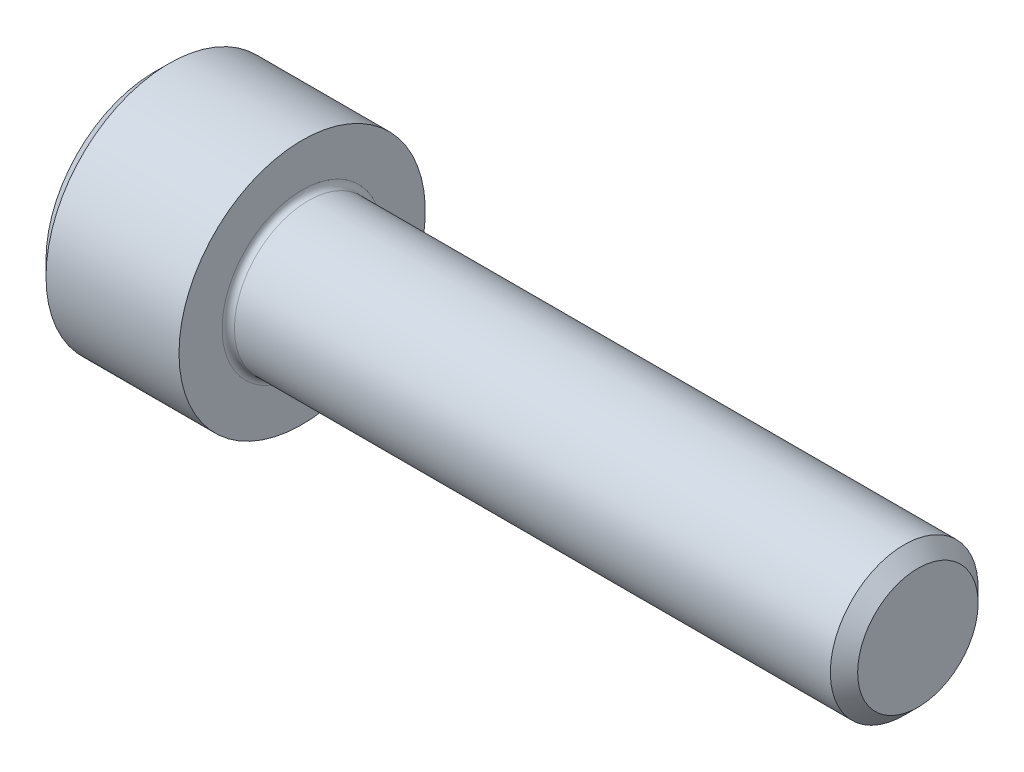
ISO-10303-21;
HEADER;
FILE_DESCRIPTION(('STEP AP214'),'2;1');
FILE_NAME('part.step','',(''),(''),'','','');
FILE_SCHEMA(('AUTOMOTIVE_DESIGN { 1 0 10303 214 1 1 1 1 }'));
ENDSEC;
DATA;
#1=APPLICATION_CONTEXT('core data for automotive mechanical design processes');
#2=APPLICATION_PROTOCOL_DEFINITION('international standard','automotive_design',2000,#1);
#3=PRODUCT_CONTEXT('',#1,'mechanical');
#4=PRODUCT('Part','Part','',(#3));
#5=PRODUCT_RELATED_PRODUCT_CATEGORY('part','',(#4));
#6=PRODUCT_DEFINITION_FORMATION('','',#4);
#7=PRODUCT_DEFINITION_CONTEXT('part definition',#1,'design');
#8=PRODUCT_DEFINITION('design','',#6,#7);
#9=PRODUCT_DEFINITION_SHAPE('','',#8);
#10=(LENGTH_UNIT() NAMED_UNIT(*) SI_UNIT(.MILLI.,.METRE.));
#11=(NAMED_UNIT(*) PLANE_ANGLE_UNIT() SI_UNIT($,.RADIAN.));
#12=(NAMED_UNIT(*) SI_UNIT($,.STERADIAN.) SOLID_ANGLE_UNIT());
#13=UNCERTAINTY_MEASURE_WITH_UNIT(LENGTH_MEASURE(1.E-05),#10,'distance_accuracy_value','');
#14=(GEOMETRIC_REPRESENTATION_CONTEXT(3) GLOBAL_UNCERTAINTY_ASSIGNED_CONTEXT((#13)) GLOBAL_UNIT_ASSIGNED_CONTEXT((#10,
#11,#12)) REPRESENTATION_CONTEXT('',''));
#15=CARTESIAN_POINT('',(0.,0.,0.));
#16=DIRECTION('',(0.,0.,1.));
#17=DIRECTION('',(1.,0.,0.));
#18=AXIS2_PLACEMENT_3D('',#15,#16,#17);
#19=CARTESIAN_POINT('',(0.,0.,0.));
#20=DIRECTION('',(-1.,0.,0.));
#21=DIRECTION('',(0.,0.,1.));
#22=AXIS2_PLACEMENT_3D('',#19,#20,#21);
#23=PLANE('',#22);
#24=DIRECTION('',(0.,-0.5,0.866025403784438));
#25=VECTOR('',#24,1.);
#26=CARTESIAN_POINT('',(0.,2.93524876856006,0.));
#27=LINE('',#26,#25);
#28=CARTESIAN_POINT('',(0.,2.93524876856006,0.));
#29=VERTEX_POINT('',#28);
#30=CARTESIAN_POINT('',(0.,1.46762438428003,2.542));
#31=VERTEX_POINT('',#30);
#32=EDGE_CURVE('E309',#29,#31,#27,.T.);
#33=ORIENTED_EDGE('',*,*,#32,.T.);
#34=DIRECTION('',(0.,1.,0.));
#35=VECTOR('',#34,1.);
#36=CARTESIAN_POINT('',(0.,-1.46762438428003,2.542));
#37=LINE('',#36,#35);
#38=CARTESIAN_POINT('',(0.,-1.46762438428003,2.542));
#39=VERTEX_POINT('',#38);
#40=EDGE_CURVE('E163',#39,#31,#37,.T.);
#41=ORIENTED_EDGE('',*,*,#40,.F.);
#42=DIRECTION('',(0.,-0.500000000000001,-0.866025403784438));
#43=VECTOR('',#42,1.);
#44=CARTESIAN_POINT('',(0.,-1.46762438428003,2.542));
#45=LINE('',#44,#43);
#46=CARTESIAN_POINT('',(0.,-2.93524876856006,0.));
#47=VERTEX_POINT('',#46);
#48=EDGE_CURVE('E314',#39,#47,#45,.T.);
#49=ORIENTED_EDGE('',*,*,#48,.T.);
#50=DIRECTION('',(0.,0.5,-0.866025403784439));
#51=VECTOR('',#50,1.);
#52=CARTESIAN_POINT('',(0.,-2.93524876856006,0.));
#53=LINE('',#52,#51);
#54=CARTESIAN_POINT('',(0.,-1.46762438428003,-2.542));
#55=VERTEX_POINT('',#54);
#56=EDGE_CURVE('E318',#47,#55,#53,.T.);
#57=ORIENTED_EDGE('',*,*,#56,.T.);
#58=DIRECTION('',(0.,-1.,0.));
#59=VECTOR('',#58,1.);
#60=CARTESIAN_POINT('',(0.,1.46762438428002,-2.542));
#61=LINE('',#60,#59);
#62=CARTESIAN_POINT('',(0.,1.46762438428002,-2.542));
#63=VERTEX_POINT('',#62);
#64=EDGE_CURVE('E322',#63,#55,#61,.T.);
#65=ORIENTED_EDGE('',*,*,#64,.F.);
#66=DIRECTION('',(0.,-0.500000000000001,-0.866025403784438));
#67=VECTOR('',#66,1.);
#68=CARTESIAN_POINT('',(0.,2.93524876856006,0.));
#69=LINE('',#68,#67);
#70=EDGE_CURVE('E158',#29,#63,#69,.T.);
#71=ORIENTED_EDGE('',*,*,#70,.F.);
#72=EDGE_LOOP('',(#33,#41,#49,#57,#65,#71));
#73=FACE_BOUND('',#72,.T.);
#74=CARTESIAN_POINT('',(0.,0.,0.));
#75=DIRECTION('',(-1.,0.,0.));
#76=DIRECTION('',(0.,0.,1.));
#77=AXIS2_PLACEMENT_3D('',#74,#75,#76);
#78=CIRCLE('',#77,4.4);
#79=CARTESIAN_POINT('',(0.,0.,4.4));
#80=VERTEX_POINT('',#79);
#81=EDGE_CURVE('E196',#80,#80,#78,.T.);
#82=ORIENTED_EDGE('',*,*,#81,.T.);
#83=EDGE_LOOP('',(#82));
#84=FACE_BOUND('',#83,.T.);
#85=ADVANCED_FACE('F45',(#73,#84),#23,.T.);
#86=CARTESIAN_POINT('',(0.,0.,0.));
#87=DIRECTION('',(1.,0.,0.));
#88=DIRECTION('',(0.,0.,-1.));
#89=AXIS2_PLACEMENT_3D('',#86,#87,#88);
#90=CONICAL_SURFACE('',#89,4.4,0.785398163397448);
#91=CARTESIAN_POINT('',(0.600000000000003,0.,0.));
#92=DIRECTION('',(-1.,0.,0.));
#93=DIRECTION('',(0.,0.,1.));
#94=AXIS2_PLACEMENT_3D('',#91,#92,#93);
#95=CIRCLE('',#94,5.);
#96=CARTESIAN_POINT('',(0.600000000000003,0.,5.));
#97=VERTEX_POINT('',#96);
#98=EDGE_CURVE('E192',#97,#97,#95,.T.);
#99=ORIENTED_EDGE('',*,*,#98,.T.);
#100=EDGE_LOOP('',(#99));
#101=FACE_BOUND('',#100,.T.);
#102=ORIENTED_EDGE('',*,*,#81,.F.);
#103=EDGE_LOOP('',(#102));
#104=FACE_BOUND('',#103,.T.);
#105=ADVANCED_FACE('F219',(#101,#104),#90,.T.);
#106=CARTESIAN_POINT('',(-31.75,0.,0.));
#107=DIRECTION('',(-1.,0.,0.));
#108=DIRECTION('',(0.,0.,1.));
#109=AXIS2_PLACEMENT_3D('',#106,#107,#108);
#110=CYLINDRICAL_SURFACE('',#109,5.);
#111=CARTESIAN_POINT('',(6.,0.,0.));
#112=DIRECTION('',(-1.,0.,0.));
#113=DIRECTION('',(0.,0.,1.));
#114=AXIS2_PLACEMENT_3D('',#111,#112,#113);
#115=CIRCLE('',#114,5.);
#116=CARTESIAN_POINT('',(6.,0.,5.));
#117=VERTEX_POINT('',#116);
#118=EDGE_CURVE('E188',#117,#117,#115,.T.);
#119=ORIENTED_EDGE('',*,*,#118,.T.);
#120=EDGE_LOOP('',(#119));
#121=FACE_BOUND('',#120,.T.);
#122=ORIENTED_EDGE('',*,*,#98,.F.);
#123=EDGE_LOOP('',(#122));
#124=FACE_BOUND('',#123,.T.);
#125=ADVANCED_FACE('F224',(#121,#124),#110,.T.);
#126=CARTESIAN_POINT('',(6.,5.,0.));
#127=DIRECTION('',(1.,0.,0.));
#128=DIRECTION('',(0.,0.,-1.));
#129=AXIS2_PLACEMENT_3D('',#126,#127,#128);
#130=PLANE('',#129);
#131=CARTESIAN_POINT('',(6.,0.,0.));
#132=DIRECTION('',(1.,0.,0.));
#133=DIRECTION('',(0.,0.,-1.));
#134=AXIS2_PLACEMENT_3D('',#131,#132,#133);
#135=CIRCLE('',#134,3.24999999999996);
#136=CARTESIAN_POINT('',(6.,0.,-3.24999999999996));
#137=VERTEX_POINT('',#136);
#138=EDGE_CURVE('E54',#137,#137,#135,.F.);
#139=ORIENTED_EDGE('',*,*,#138,.T.);
#140=EDGE_LOOP('',(#139));
#141=FACE_BOUND('',#140,.T.);
#142=ORIENTED_EDGE('',*,*,#118,.F.);
#143=EDGE_LOOP('',(#142));
#144=FACE_BOUND('',#143,.T.);
#145=ADVANCED_FACE('F203',(#141,#144),#130,.T.);
#146=CARTESIAN_POINT('',(-31.75,0.,0.));
#147=DIRECTION('',(-1.,0.,0.));
#148=DIRECTION('',(0.,0.,1.));
#149=AXIS2_PLACEMENT_3D('',#146,#147,#148);
#150=CYLINDRICAL_SURFACE('',#149,2.99999999999996);
#151=CARTESIAN_POINT('',(6.25,0.,0.));
#152=DIRECTION('',(1.,0.,0.));
#153=DIRECTION('',(0.,0.,-1.));
#154=AXIS2_PLACEMENT_3D('',#151,#152,#153);
#155=CIRCLE('',#154,2.99999999999996);
#156=CARTESIAN_POINT('',(6.25,0.,-2.99999999999996));
#157=VERTEX_POINT('',#156);
#158=EDGE_CURVE('E11',#157,#157,#155,.T.);
#159=ORIENTED_EDGE('',*,*,#158,.T.);
#160=EDGE_LOOP('',(#159));
#161=FACE_BOUND('',#160,.T.);
#162=CARTESIAN_POINT('',(30.4454999999999,0.,0.));
#163=DIRECTION('',(-1.,0.,0.));
#164=DIRECTION('',(0.,0.,1.));
#165=AXIS2_PLACEMENT_3D('',#162,#163,#164);
#166=CIRCLE('',#165,2.99999999999991);
#167=CARTESIAN_POINT('',(30.4454999999999,0.,2.99999999999991));
#168=VERTEX_POINT('',#167);
#169=EDGE_CURVE('E184',#168,#168,#166,.T.);
#170=ORIENTED_EDGE('',*,*,#169,.T.);
#171=EDGE_LOOP('',(#170));
#172=FACE_BOUND('',#171,.T.);
#173=ADVANCED_FACE('F234',(#161,#172),#150,.T.);
#174=CARTESIAN_POINT('',(31.,0.,0.));
#175=DIRECTION('',(-1.,0.,0.));
#176=DIRECTION('',(0.,0.,1.));
#177=AXIS2_PLACEMENT_3D('',#174,#175,#176);
#178=CONICAL_SURFACE('',#177,2.4455,0.785398163397305);
#179=ORIENTED_EDGE('',*,*,#169,.F.);
#180=EDGE_LOOP('',(#179));
#181=FACE_BOUND('',#180,.T.);
#182=CARTESIAN_POINT('',(31.,0.,0.));
#183=DIRECTION('',(-1.,0.,0.));
#184=DIRECTION('',(0.,0.,1.));
#185=AXIS2_PLACEMENT_3D('',#182,#183,#184);
#186=CIRCLE('',#185,2.4455);
#187=CARTESIAN_POINT('',(31.,0.,2.4455));
#188=VERTEX_POINT('',#187);
#189=EDGE_CURVE('E179',#188,#188,#186,.T.);
#190=ORIENTED_EDGE('',*,*,#189,.T.);
#191=EDGE_LOOP('',(#190));
#192=FACE_BOUND('',#191,.T.);
#193=ADVANCED_FACE('F214',(#181,#192),#178,.T.);
#194=CARTESIAN_POINT('',(31.,2.4455,0.));
#195=DIRECTION('',(1.,0.,0.));
#196=DIRECTION('',(0.,0.,-1.));
#197=AXIS2_PLACEMENT_3D('',#194,#195,#196);
#198=PLANE('',#197);
#199=ORIENTED_EDGE('',*,*,#189,.F.);
#200=EDGE_LOOP('',(#199));
#201=FACE_BOUND('',#200,.T.);
#202=ADVANCED_FACE('F207',(#201),#198,.T.);
#203=CARTESIAN_POINT('',(6.25,0.,0.));
#204=DIRECTION('',(1.,0.,0.));
#205=DIRECTION('',(0.,0.,-1.));
#206=AXIS2_PLACEMENT_3D('',#203,#204,#205);
#207=TOROIDAL_SURFACE('',#206,3.24999999999996,0.25);
#208=ORIENTED_EDGE('',*,*,#158,.F.);
#209=EDGE_LOOP('',(#208));
#210=FACE_BOUND('',#209,.T.);
#211=ORIENTED_EDGE('',*,*,#138,.F.);
#212=EDGE_LOOP('',(#211));
#213=FACE_BOUND('',#212,.T.);
#214=ADVANCED_FACE('F47',(#210,#213),#207,.F.);
#215=CARTESIAN_POINT('',(3.,2.93524876856006,0.));
#216=DIRECTION('',(0.,-0.866025403784439,-0.5));
#217=DIRECTION('',(0.,0.5,-0.866025403784439));
#218=AXIS2_PLACEMENT_3D('',#215,#216,#217);
#219=PLANE('',#218);
#220=ORIENTED_EDGE('',*,*,#32,.F.);
#221=DIRECTION('',(-1.,0.,0.));
#222=VECTOR('',#221,1.);
#223=CARTESIAN_POINT('',(3.,2.93524876856006,0.));
#224=LINE('',#223,#222);
#225=CARTESIAN_POINT('',(3.,2.93524876856006,0.));
#226=VERTEX_POINT('',#225);
#227=EDGE_CURVE('E295',#226,#29,#224,.T.);
#228=ORIENTED_EDGE('',*,*,#227,.F.);
#229=DIRECTION('',(0.,-0.5,0.866025403784438));
#230=VECTOR('',#229,1.);
#231=CARTESIAN_POINT('',(3.,2.93524876856006,0.));
#232=LINE('',#231,#230);
#233=CARTESIAN_POINT('',(3.,2.20143657642004,1.271));
#234=VERTEX_POINT('',#233);
#235=EDGE_CURVE('E149',#226,#234,#232,.T.);
#236=ORIENTED_EDGE('',*,*,#235,.T.);
#237=CARTESIAN_POINT('',(3.,1.46762438428003,2.542));
#238=VERTEX_POINT('',#237);
#239=EDGE_CURVE('E139',#234,#238,#232,.T.);
#240=ORIENTED_EDGE('',*,*,#239,.T.);
#241=DIRECTION('',(-1.,0.,0.));
#242=VECTOR('',#241,1.);
#243=CARTESIAN_POINT('',(3.,1.46762438428003,2.542));
#244=LINE('',#243,#242);
#245=EDGE_CURVE('E154',#238,#31,#244,.T.);
#246=ORIENTED_EDGE('',*,*,#245,.T.);
#247=EDGE_LOOP('',(#220,#228,#236,#240,#246));
#248=FACE_BOUND('',#247,.T.);
#249=ADVANCED_FACE('F153',(#248),#219,.T.);
#250=CARTESIAN_POINT('',(3.,-1.46762438428003,2.542));
#251=DIRECTION('',(0.,0.,1.));
#252=DIRECTION('',(0.,-1.,0.));
#253=AXIS2_PLACEMENT_3D('',#250,#251,#252);
#254=PLANE('',#253);
#255=ORIENTED_EDGE('',*,*,#40,.T.);
#256=ORIENTED_EDGE('',*,*,#245,.F.);
#257=DIRECTION('',(0.,1.,0.));
#258=VECTOR('',#257,1.);
#259=CARTESIAN_POINT('',(3.,-1.46762438428003,2.542));
#260=LINE('',#259,#258);
#261=CARTESIAN_POINT('',(3.,0.,2.542));
#262=VERTEX_POINT('',#261);
#263=EDGE_CURVE('E136',#262,#238,#260,.T.);
#264=ORIENTED_EDGE('',*,*,#263,.F.);
#265=CARTESIAN_POINT('',(3.,-1.46762438428003,2.542));
#266=VERTEX_POINT('',#265);
#267=EDGE_CURVE('E148',#266,#262,#260,.T.);
#268=ORIENTED_EDGE('',*,*,#267,.F.);
#269=DIRECTION('',(-1.,0.,0.));
#270=VECTOR('',#269,1.);
#271=CARTESIAN_POINT('',(3.,-1.46762438428003,2.542));
#272=LINE('',#271,#270);
#273=EDGE_CURVE('E166',#266,#39,#272,.T.);
#274=ORIENTED_EDGE('',*,*,#273,.T.);
#275=EDGE_LOOP('',(#255,#256,#264,#268,#274));
#276=FACE_BOUND('',#275,.T.);
#277=ADVANCED_FACE('F160',(#276),#254,.F.);
#278=CARTESIAN_POINT('',(3.,-1.46762438428003,2.542));
#279=DIRECTION('',(0.,0.866025403784438,-0.500000000000001));
#280=DIRECTION('',(0.,0.500000000000001,0.866025403784438));
#281=AXIS2_PLACEMENT_3D('',#278,#279,#280);
#282=PLANE('',#281);
#283=ORIENTED_EDGE('',*,*,#48,.F.);
#284=ORIENTED_EDGE('',*,*,#273,.F.);
#285=DIRECTION('',(0.,-0.500000000000001,-0.866025403784438));
#286=VECTOR('',#285,1.);
#287=CARTESIAN_POINT('',(3.,-1.46762438428003,2.542));
#288=LINE('',#287,#286);
#289=CARTESIAN_POINT('',(3.,-2.20143657642004,1.271));
#290=VERTEX_POINT('',#289);
#291=EDGE_CURVE('E353',#266,#290,#288,.T.);
#292=ORIENTED_EDGE('',*,*,#291,.T.);
#293=CARTESIAN_POINT('',(3.,-2.93524876856006,0.));
#294=VERTEX_POINT('',#293);
#295=EDGE_CURVE('E338',#290,#294,#288,.T.);
#296=ORIENTED_EDGE('',*,*,#295,.T.);
#297=DIRECTION('',(-1.,0.,0.));
#298=VECTOR('',#297,1.);
#299=CARTESIAN_POINT('',(3.,-2.93524876856006,0.));
#300=LINE('',#299,#298);
#301=EDGE_CURVE('E174',#294,#47,#300,.T.);
#302=ORIENTED_EDGE('',*,*,#301,.T.);
#303=EDGE_LOOP('',(#283,#284,#292,#296,#302));
#304=FACE_BOUND('',#303,.T.);
#305=ADVANCED_FACE('F247',(#304),#282,.T.);
#306=CARTESIAN_POINT('',(3.,-2.93524876856006,0.));
#307=DIRECTION('',(0.,0.866025403784439,0.5));
#308=DIRECTION('',(0.,-0.5,0.866025403784439));
#309=AXIS2_PLACEMENT_3D('',#306,#307,#308);
#310=PLANE('',#309);
#311=ORIENTED_EDGE('',*,*,#56,.F.);
#312=ORIENTED_EDGE('',*,*,#301,.F.);
#313=DIRECTION('',(0.,0.5,-0.866025403784439));
#314=VECTOR('',#313,1.);
#315=CARTESIAN_POINT('',(3.,-2.93524876856006,0.));
#316=LINE('',#315,#314);
#317=CARTESIAN_POINT('',(3.,-2.20143657642005,-1.271));
#318=VERTEX_POINT('',#317);
#319=EDGE_CURVE('E304',#294,#318,#316,.T.);
#320=ORIENTED_EDGE('',*,*,#319,.T.);
#321=CARTESIAN_POINT('',(3.,-1.46762438428003,-2.542));
#322=VERTEX_POINT('',#321);
#323=EDGE_CURVE('E351',#318,#322,#316,.T.);
#324=ORIENTED_EDGE('',*,*,#323,.T.);
#325=DIRECTION('',(-1.,0.,0.));
#326=VECTOR('',#325,1.);
#327=CARTESIAN_POINT('',(3.,-1.46762438428003,-2.542));
#328=LINE('',#327,#326);
#329=EDGE_CURVE('E294',#322,#55,#328,.T.);
#330=ORIENTED_EDGE('',*,*,#329,.T.);
#331=EDGE_LOOP('',(#311,#312,#320,#324,#330));
#332=FACE_BOUND('',#331,.T.);
#333=ADVANCED_FACE('F250',(#332),#310,.T.);
#334=CARTESIAN_POINT('',(3.,1.46762438428002,-2.542));
#335=DIRECTION('',(0.,0.,-1.));
#336=DIRECTION('',(0.,1.,0.));
#337=AXIS2_PLACEMENT_3D('',#334,#335,#336);
#338=PLANE('',#337);
#339=ORIENTED_EDGE('',*,*,#64,.T.);
#340=ORIENTED_EDGE('',*,*,#329,.F.);
#341=DIRECTION('',(0.,-1.,0.));
#342=VECTOR('',#341,1.);
#343=CARTESIAN_POINT('',(3.,1.46762438428002,-2.542));
#344=LINE('',#343,#342);
#345=CARTESIAN_POINT('',(3.,0.,-2.542));
#346=VERTEX_POINT('',#345);
#347=EDGE_CURVE('E298',#346,#322,#344,.T.);
#348=ORIENTED_EDGE('',*,*,#347,.F.);
#349=CARTESIAN_POINT('',(3.,1.46762438428002,-2.542));
#350=VERTEX_POINT('',#349);
#351=EDGE_CURVE('E64',#350,#346,#344,.T.);
#352=ORIENTED_EDGE('',*,*,#351,.F.);
#353=DIRECTION('',(-1.,0.,0.));
#354=VECTOR('',#353,1.);
#355=CARTESIAN_POINT('',(3.,1.46762438428002,-2.542));
#356=LINE('',#355,#354);
#357=EDGE_CURVE('E290',#350,#63,#356,.T.);
#358=ORIENTED_EDGE('',*,*,#357,.T.);
#359=EDGE_LOOP('',(#339,#340,#348,#352,#358));
#360=FACE_BOUND('',#359,.T.);
#361=ADVANCED_FACE('F254',(#360),#338,.F.);
#362=CARTESIAN_POINT('',(3.,2.93524876856006,0.));
#363=DIRECTION('',(0.,0.866025403784438,-0.500000000000001));
#364=DIRECTION('',(0.,0.500000000000001,0.866025403784438));
#365=AXIS2_PLACEMENT_3D('',#362,#363,#364);
#366=PLANE('',#365);
#367=ORIENTED_EDGE('',*,*,#70,.T.);
#368=ORIENTED_EDGE('',*,*,#357,.F.);
#369=DIRECTION('',(0.,-0.500000000000001,-0.866025403784438));
#370=VECTOR('',#369,1.);
#371=CARTESIAN_POINT('',(3.,2.93524876856006,0.));
#372=LINE('',#371,#370);
#373=CARTESIAN_POINT('',(3.,2.20143657642004,-1.271));
#374=VERTEX_POINT('',#373);
#375=EDGE_CURVE('E279',#374,#350,#372,.T.);
#376=ORIENTED_EDGE('',*,*,#375,.F.);
#377=EDGE_CURVE('E286',#226,#374,#372,.T.);
#378=ORIENTED_EDGE('',*,*,#377,.F.);
#379=ORIENTED_EDGE('',*,*,#227,.T.);
#380=EDGE_LOOP('',(#367,#368,#376,#378,#379));
#381=FACE_BOUND('',#380,.T.);
#382=ADVANCED_FACE('F258',(#381),#366,.F.);
#383=CARTESIAN_POINT('',(3.,2.93524876856006,0.));
#384=DIRECTION('',(1.,0.,0.));
#385=DIRECTION('',(0.,0.,-1.));
#386=AXIS2_PLACEMENT_3D('',#383,#384,#385);
#387=PLANE('',#386);
#388=ORIENTED_EDGE('',*,*,#347,.T.);
#389=ORIENTED_EDGE('',*,*,#323,.F.);
#390=CARTESIAN_POINT('',(3.,0.,0.));
#391=DIRECTION('',(-1.,0.,0.));
#392=DIRECTION('',(0.,0.,1.));
#393=AXIS2_PLACEMENT_3D('',#390,#391,#392);
#394=CIRCLE('',#393,2.542);
#395=EDGE_CURVE('E347',#346,#318,#394,.T.);
#396=ORIENTED_EDGE('',*,*,#395,.F.);
#397=EDGE_LOOP('',(#388,#389,#396));
#398=FACE_BOUND('',#397,.T.);
#399=ADVANCED_FACE('F262',(#398),#387,.F.);
#400=ORIENTED_EDGE('',*,*,#319,.F.);
#401=ORIENTED_EDGE('',*,*,#295,.F.);
#402=EDGE_CURVE('E171',#318,#290,#394,.T.);
#403=ORIENTED_EDGE('',*,*,#402,.F.);
#404=EDGE_LOOP('',(#400,#401,#403));
#405=FACE_BOUND('',#404,.T.);
#406=ADVANCED_FACE('F265',(#405),#387,.F.);
#407=ORIENTED_EDGE('',*,*,#291,.F.);
#408=ORIENTED_EDGE('',*,*,#267,.T.);
#409=EDGE_CURVE('E165',#290,#262,#394,.T.);
#410=ORIENTED_EDGE('',*,*,#409,.F.);
#411=EDGE_LOOP('',(#407,#408,#410));
#412=FACE_BOUND('',#411,.T.);
#413=ADVANCED_FACE('F270',(#412),#387,.F.);
#414=ORIENTED_EDGE('',*,*,#263,.T.);
#415=ORIENTED_EDGE('',*,*,#239,.F.);
#416=EDGE_CURVE('E142',#262,#234,#394,.T.);
#417=ORIENTED_EDGE('',*,*,#416,.F.);
#418=EDGE_LOOP('',(#414,#415,#417));
#419=FACE_BOUND('',#418,.T.);
#420=ADVANCED_FACE('F138',(#419),#387,.F.);
#421=ORIENTED_EDGE('',*,*,#235,.F.);
#422=ORIENTED_EDGE('',*,*,#377,.T.);
#423=EDGE_CURVE('E180',#234,#374,#394,.T.);
#424=ORIENTED_EDGE('',*,*,#423,.F.);
#425=EDGE_LOOP('',(#421,#422,#424));
#426=FACE_BOUND('',#425,.T.);
#427=ADVANCED_FACE('F273',(#426),#387,.F.);
#428=ORIENTED_EDGE('',*,*,#375,.T.);
#429=ORIENTED_EDGE('',*,*,#351,.T.);
#430=EDGE_CURVE('E282',#374,#346,#394,.T.);
#431=ORIENTED_EDGE('',*,*,#430,.F.);
#432=EDGE_LOOP('',(#428,#429,#431));
#433=FACE_BOUND('',#432,.T.);
#434=ADVANCED_FACE('F243',(#433),#387,.F.);
#435=CARTESIAN_POINT('',(3.,0.,0.));
#436=DIRECTION('',(-1.,0.,0.));
#437=DIRECTION('',(0.,0.,1.));
#438=AXIS2_PLACEMENT_3D('',#435,#436,#437);
#439=CONICAL_SURFACE('',#438,2.542,1.04719755119659);
#440=CARTESIAN_POINT('',(4.46762438428004,0.,0.));
#441=VERTEX_POINT('',#440);
#442=VERTEX_LOOP('',#441);
#443=FACE_BOUND('',#442,.T.);
#444=ORIENTED_EDGE('',*,*,#416,.T.);
#445=ORIENTED_EDGE('',*,*,#423,.T.);
#446=ORIENTED_EDGE('',*,*,#430,.T.);
#447=ORIENTED_EDGE('',*,*,#395,.T.);
#448=ORIENTED_EDGE('',*,*,#402,.T.);
#449=ORIENTED_EDGE('',*,*,#409,.T.);
#450=EDGE_LOOP('',(#444,#445,#446,#447,#448,#449));
#451=FACE_BOUND('',#450,.T.);
#452=ADVANCED_FACE('F241',(#443,#451),#439,.F.);
#453=CLOSED_SHELL('',(#85,#105,#125,#145,#173,#193,#202,#214,#249,#277,#305,#333,#361,#382,#399,
#406,#413,#420,#427,#434,#452));
#454=MANIFOLD_SOLID_BREP('B2',#453);
#455=ADVANCED_BREP_SHAPE_REPRESENTATION('',(#18,#454),#14);
#456=SHAPE_DEFINITION_REPRESENTATION(#9,#455);
ENDSEC;
END-ISO-10303-21;
